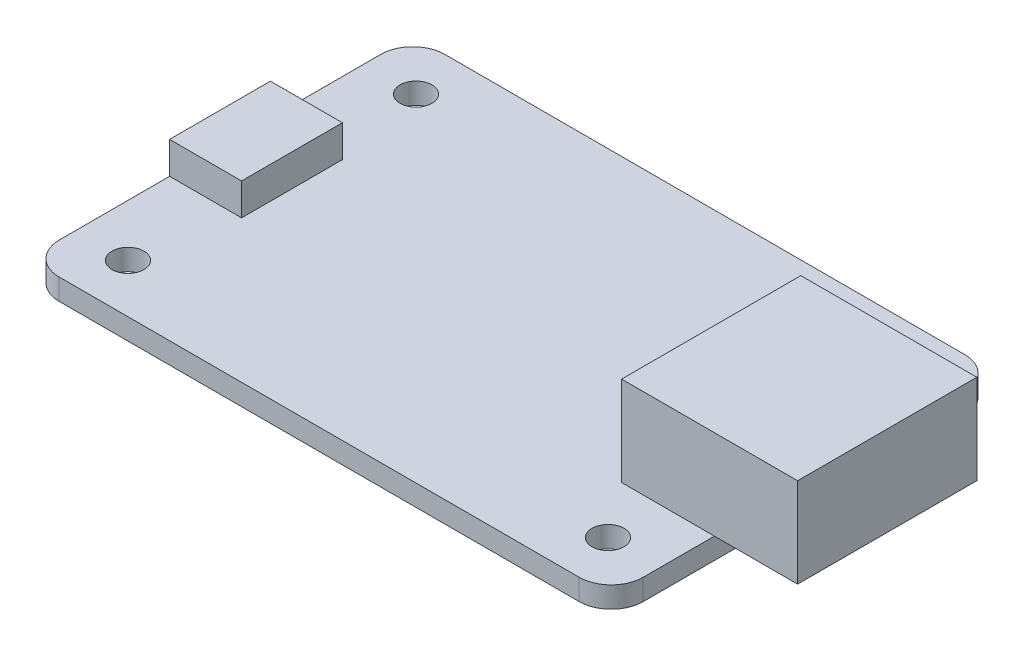
ISO-10303-21;
HEADER;
FILE_DESCRIPTION(('STEP AP214'),'2;1');
FILE_NAME('part.step','',(''),(''),'','','');
FILE_SCHEMA(('AUTOMOTIVE_DESIGN { 1 0 10303 214 1 1 1 1 }'));
ENDSEC;
DATA;
#1=APPLICATION_CONTEXT('core data for automotive mechanical design processes');
#2=APPLICATION_PROTOCOL_DEFINITION('international standard','automotive_design',2000,#1);
#3=PRODUCT_CONTEXT('',#1,'mechanical');
#4=PRODUCT('Part','Part','',(#3));
#5=PRODUCT_RELATED_PRODUCT_CATEGORY('part','',(#4));
#6=PRODUCT_DEFINITION_FORMATION('','',#4);
#7=PRODUCT_DEFINITION_CONTEXT('part definition',#1,'design');
#8=PRODUCT_DEFINITION('design','',#6,#7);
#9=PRODUCT_DEFINITION_SHAPE('','',#8);
#10=(LENGTH_UNIT() NAMED_UNIT(*) SI_UNIT(.MILLI.,.METRE.));
#11=(NAMED_UNIT(*) PLANE_ANGLE_UNIT() SI_UNIT($,.RADIAN.));
#12=(NAMED_UNIT(*) SI_UNIT($,.STERADIAN.) SOLID_ANGLE_UNIT());
#13=UNCERTAINTY_MEASURE_WITH_UNIT(LENGTH_MEASURE(1.E-05),#10,'distance_accuracy_value','');
#14=(GEOMETRIC_REPRESENTATION_CONTEXT(3) GLOBAL_UNCERTAINTY_ASSIGNED_CONTEXT((#13)) GLOBAL_UNIT_ASSIGNED_CONTEXT((#10,
#11,#12)) REPRESENTATION_CONTEXT('',''));
#15=CARTESIAN_POINT('',(0.,0.,0.));
#16=DIRECTION('',(0.,0.,1.));
#17=DIRECTION('',(1.,0.,0.));
#18=AXIS2_PLACEMENT_3D('',#15,#16,#17);
#19=CARTESIAN_POINT('',(0.,1.6764,0.));
#20=DIRECTION('',(0.,-1.,0.));
#21=DIRECTION('',(0.,0.,-1.));
#22=AXIS2_PLACEMENT_3D('',#19,#20,#21);
#23=PLANE('',#22);
#24=CARTESIAN_POINT('',(4.1275,1.6764,-26.7335));
#25=DIRECTION('',(0.,1.,0.));
#26=DIRECTION('',(0.,0.,1.));
#27=AXIS2_PLACEMENT_3D('',#24,#25,#26);
#28=CIRCLE('',#27,1.27);
#29=CARTESIAN_POINT('',(4.1275,1.6764,-25.4635));
#30=VERTEX_POINT('',#29);
#31=EDGE_CURVE('E266',#30,#30,#28,.T.);
#32=ORIENTED_EDGE('',*,*,#31,.F.);
#33=EDGE_LOOP('',(#32));
#34=FACE_BOUND('',#33,.T.);
#35=CARTESIAN_POINT('',(42.2275,1.6764,-26.7335));
#36=DIRECTION('',(0.,1.,0.));
#37=DIRECTION('',(0.,0.,1.));
#38=AXIS2_PLACEMENT_3D('',#35,#36,#37);
#39=CIRCLE('',#38,1.27);
#40=CARTESIAN_POINT('',(42.2275,1.6764,-25.4635));
#41=VERTEX_POINT('',#40);
#42=EDGE_CURVE('E258',#41,#41,#39,.T.);
#43=ORIENTED_EDGE('',*,*,#42,.F.);
#44=EDGE_LOOP('',(#43));
#45=FACE_BOUND('',#44,.T.);
#46=CARTESIAN_POINT('',(4.1275,1.6764,-3.8735));
#47=DIRECTION('',(0.,1.,0.));
#48=DIRECTION('',(0.,0.,1.));
#49=AXIS2_PLACEMENT_3D('',#46,#47,#48);
#50=CIRCLE('',#49,1.27);
#51=CARTESIAN_POINT('',(4.1275,1.6764,-2.6035));
#52=VERTEX_POINT('',#51);
#53=EDGE_CURVE('E250',#52,#52,#50,.T.);
#54=ORIENTED_EDGE('',*,*,#53,.F.);
#55=EDGE_LOOP('',(#54));
#56=FACE_BOUND('',#55,.T.);
#57=CARTESIAN_POINT('',(42.2275,1.6764,-3.8735));
#58=DIRECTION('',(0.,1.,0.));
#59=DIRECTION('',(0.,0.,1.));
#60=AXIS2_PLACEMENT_3D('',#57,#58,#59);
#61=CIRCLE('',#60,1.27);
#62=CARTESIAN_POINT('',(42.2275,1.6764,-2.60350000000001));
#63=VERTEX_POINT('',#62);
#64=EDGE_CURVE('E242',#63,#63,#61,.T.);
#65=ORIENTED_EDGE('',*,*,#64,.F.);
#66=EDGE_LOOP('',(#65));
#67=FACE_BOUND('',#66,.T.);
#68=DIRECTION('',(1.,0.,0.));
#69=VECTOR('',#68,1.);
#70=CARTESIAN_POINT('',(0.,1.6764,0.));
#71=LINE('',#70,#69);
#72=CARTESIAN_POINT('',(2.54,1.6764,0.));
#73=VERTEX_POINT('',#72);
#74=CARTESIAN_POINT('',(43.815,1.6764,0.));
#75=VERTEX_POINT('',#74);
#76=EDGE_CURVE('E277',#73,#75,#71,.T.);
#77=ORIENTED_EDGE('',*,*,#76,.T.);
#78=CARTESIAN_POINT('',(43.815,1.6764,-2.54));
#79=DIRECTION('',(0.,-1.,0.));
#80=DIRECTION('',(0.,0.,-1.));
#81=AXIS2_PLACEMENT_3D('',#78,#79,#80);
#82=CIRCLE('',#81,2.54);
#83=CARTESIAN_POINT('',(46.355,1.6764,-2.54));
#84=VERTEX_POINT('',#83);
#85=EDGE_CURVE('E336',#75,#84,#82,.F.);
#86=ORIENTED_EDGE('',*,*,#85,.T.);
#87=DIRECTION('',(0.,0.,-1.));
#88=VECTOR('',#87,1.);
#89=CARTESIAN_POINT('',(46.355,1.6764,0.));
#90=LINE('',#89,#88);
#91=CARTESIAN_POINT('',(46.355,1.6764,-8.1915));
#92=VERTEX_POINT('',#91);
#93=EDGE_CURVE('E282',#84,#92,#90,.T.);
#94=ORIENTED_EDGE('',*,*,#93,.T.);
#95=DIRECTION('',(1.,0.,0.));
#96=VECTOR('',#95,1.);
#97=CARTESIAN_POINT('',(38.989,1.6764,-8.1915));
#98=LINE('',#97,#96);
#99=CARTESIAN_POINT('',(38.989,1.6764,-8.1915));
#100=VERTEX_POINT('',#99);
#101=EDGE_CURVE('E204',#100,#92,#98,.T.);
#102=ORIENTED_EDGE('',*,*,#101,.F.);
#103=DIRECTION('',(0.,0.,1.));
#104=VECTOR('',#103,1.);
#105=CARTESIAN_POINT('',(38.989,1.6764,-8.1915));
#106=LINE('',#105,#104);
#107=CARTESIAN_POINT('',(38.989,1.6764,-22.4155));
#108=VERTEX_POINT('',#107);
#109=EDGE_CURVE('E217',#108,#100,#106,.T.);
#110=ORIENTED_EDGE('',*,*,#109,.F.);
#111=DIRECTION('',(-1.,0.,0.));
#112=VECTOR('',#111,1.);
#113=CARTESIAN_POINT('',(38.989,1.6764,-22.4155));
#114=LINE('',#113,#112);
#115=CARTESIAN_POINT('',(46.355,1.6764,-22.4155));
#116=VERTEX_POINT('',#115);
#117=EDGE_CURVE('E218',#116,#108,#114,.T.);
#118=ORIENTED_EDGE('',*,*,#117,.F.);
#119=CARTESIAN_POINT('',(46.355,1.6764,-28.067));
#120=VERTEX_POINT('',#119);
#121=EDGE_CURVE('E281',#116,#120,#90,.T.);
#122=ORIENTED_EDGE('',*,*,#121,.T.);
#123=CARTESIAN_POINT('',(43.815,1.6764,-28.067));
#124=DIRECTION('',(0.,-1.,0.));
#125=DIRECTION('',(0.,0.,-1.));
#126=AXIS2_PLACEMENT_3D('',#123,#124,#125);
#127=CIRCLE('',#126,2.54);
#128=CARTESIAN_POINT('',(43.815,1.6764,-30.607));
#129=VERTEX_POINT('',#128);
#130=EDGE_CURVE('E328',#120,#129,#127,.F.);
#131=ORIENTED_EDGE('',*,*,#130,.T.);
#132=DIRECTION('',(-1.,0.,0.));
#133=VECTOR('',#132,1.);
#134=CARTESIAN_POINT('',(0.,1.6764,-30.607));
#135=LINE('',#134,#133);
#136=CARTESIAN_POINT('',(2.54,1.6764,-30.607));
#137=VERTEX_POINT('',#136);
#138=EDGE_CURVE('E285',#129,#137,#135,.T.);
#139=ORIENTED_EDGE('',*,*,#138,.T.);
#140=CARTESIAN_POINT('',(2.54,1.6764,-28.067));
#141=DIRECTION('',(0.,-1.,0.));
#142=DIRECTION('',(0.,0.,-1.));
#143=AXIS2_PLACEMENT_3D('',#140,#141,#142);
#144=CIRCLE('',#143,2.54);
#145=CARTESIAN_POINT('',(0.,1.6764,-28.067));
#146=VERTEX_POINT('',#145);
#147=EDGE_CURVE('E54',#137,#146,#144,.F.);
#148=ORIENTED_EDGE('',*,*,#147,.T.);
#149=DIRECTION('',(0.,0.,1.));
#150=VECTOR('',#149,1.);
#151=CARTESIAN_POINT('',(0.,1.6764,0.));
#152=LINE('',#151,#150);
#153=CARTESIAN_POINT('',(0.,1.6764,-19.304));
#154=VERTEX_POINT('',#153);
#155=EDGE_CURVE('E274',#146,#154,#152,.T.);
#156=ORIENTED_EDGE('',*,*,#155,.T.);
#157=DIRECTION('',(-1.,0.,0.));
#158=VECTOR('',#157,1.);
#159=CARTESIAN_POINT('',(5.715,1.6764,-19.304));
#160=LINE('',#159,#158);
#161=CARTESIAN_POINT('',(5.715,1.6764,-19.304));
#162=VERTEX_POINT('',#161);
#163=EDGE_CURVE('E180',#162,#154,#160,.T.);
#164=ORIENTED_EDGE('',*,*,#163,.F.);
#165=DIRECTION('',(0.,0.,-1.));
#166=VECTOR('',#165,1.);
#167=CARTESIAN_POINT('',(5.715,1.6764,-19.304));
#168=LINE('',#167,#166);
#169=CARTESIAN_POINT('',(5.715,1.6764,-11.303));
#170=VERTEX_POINT('',#169);
#171=EDGE_CURVE('E369',#170,#162,#168,.T.);
#172=ORIENTED_EDGE('',*,*,#171,.F.);
#173=DIRECTION('',(1.,0.,0.));
#174=VECTOR('',#173,1.);
#175=CARTESIAN_POINT('',(5.715,1.6764,-11.303));
#176=LINE('',#175,#174);
#177=CARTESIAN_POINT('',(0.,1.6764,-11.303));
#178=VERTEX_POINT('',#177);
#179=EDGE_CURVE('E372',#178,#170,#176,.T.);
#180=ORIENTED_EDGE('',*,*,#179,.F.);
#181=CARTESIAN_POINT('',(0.,1.6764,-2.54));
#182=VERTEX_POINT('',#181);
#183=EDGE_CURVE('E185',#178,#182,#152,.T.);
#184=ORIENTED_EDGE('',*,*,#183,.T.);
#185=CARTESIAN_POINT('',(2.54,1.6764,-2.54));
#186=DIRECTION('',(0.,-1.,0.));
#187=DIRECTION('',(0.,0.,-1.));
#188=AXIS2_PLACEMENT_3D('',#185,#186,#187);
#189=CIRCLE('',#188,2.54);
#190=EDGE_CURVE('E333',#182,#73,#189,.F.);
#191=ORIENTED_EDGE('',*,*,#190,.T.);
#192=EDGE_LOOP('',(#77,#86,#94,#102,#110,#118,#122,#131,#139,#148,#156,#164,#172,#180,#184,#191));
#193=FACE_BOUND('',#192,.T.);
#194=ADVANCED_FACE('F38',(#34,#45,#56,#67,#193),#23,.F.);
#195=CARTESIAN_POINT('',(0.,0.,0.));
#196=DIRECTION('',(0.,-1.,0.));
#197=DIRECTION('',(0.,0.,-1.));
#198=AXIS2_PLACEMENT_3D('',#195,#196,#197);
#199=PLANE('',#198);
#200=CARTESIAN_POINT('',(4.1275,0.,-3.8735));
#201=DIRECTION('',(0.,1.,0.));
#202=DIRECTION('',(0.,0.,1.));
#203=AXIS2_PLACEMENT_3D('',#200,#201,#202);
#204=CIRCLE('',#203,1.27);
#205=CARTESIAN_POINT('',(4.1275,0.,-2.6035));
#206=VERTEX_POINT('',#205);
#207=EDGE_CURVE('E246',#206,#206,#204,.T.);
#208=ORIENTED_EDGE('',*,*,#207,.T.);
#209=EDGE_LOOP('',(#208));
#210=FACE_BOUND('',#209,.T.);
#211=CARTESIAN_POINT('',(4.1275,0.,-26.7335));
#212=DIRECTION('',(0.,1.,0.));
#213=DIRECTION('',(0.,0.,1.));
#214=AXIS2_PLACEMENT_3D('',#211,#212,#213);
#215=CIRCLE('',#214,1.27);
#216=CARTESIAN_POINT('',(4.1275,0.,-25.4635));
#217=VERTEX_POINT('',#216);
#218=EDGE_CURVE('E262',#217,#217,#215,.T.);
#219=ORIENTED_EDGE('',*,*,#218,.T.);
#220=EDGE_LOOP('',(#219));
#221=FACE_BOUND('',#220,.T.);
#222=DIRECTION('',(0.,0.,-1.));
#223=VECTOR('',#222,1.);
#224=CARTESIAN_POINT('',(46.355,0.,0.));
#225=LINE('',#224,#223);
#226=CARTESIAN_POINT('',(46.355,0.,-2.54));
#227=VERTEX_POINT('',#226);
#228=CARTESIAN_POINT('',(46.355,0.,-28.067));
#229=VERTEX_POINT('',#228);
#230=EDGE_CURVE('E295',#227,#229,#225,.T.);
#231=ORIENTED_EDGE('',*,*,#230,.F.);
#232=CARTESIAN_POINT('',(43.815,0.,-2.54));
#233=DIRECTION('',(0.,-1.,0.));
#234=DIRECTION('',(0.,0.,-1.));
#235=AXIS2_PLACEMENT_3D('',#232,#233,#234);
#236=CIRCLE('',#235,2.54);
#237=CARTESIAN_POINT('',(43.815,0.,0.));
#238=VERTEX_POINT('',#237);
#239=EDGE_CURVE('E318',#227,#238,#236,.T.);
#240=ORIENTED_EDGE('',*,*,#239,.T.);
#241=DIRECTION('',(1.,0.,0.));
#242=VECTOR('',#241,1.);
#243=CARTESIAN_POINT('',(0.,0.,0.));
#244=LINE('',#243,#242);
#245=CARTESIAN_POINT('',(2.54,0.,0.));
#246=VERTEX_POINT('',#245);
#247=EDGE_CURVE('E291',#246,#238,#244,.T.);
#248=ORIENTED_EDGE('',*,*,#247,.F.);
#249=CARTESIAN_POINT('',(2.54,0.,-2.54));
#250=DIRECTION('',(0.,-1.,0.));
#251=DIRECTION('',(0.,0.,-1.));
#252=AXIS2_PLACEMENT_3D('',#249,#250,#251);
#253=CIRCLE('',#252,2.54);
#254=CARTESIAN_POINT('',(0.,0.,-2.54));
#255=VERTEX_POINT('',#254);
#256=EDGE_CURVE('E315',#246,#255,#253,.T.);
#257=ORIENTED_EDGE('',*,*,#256,.T.);
#258=DIRECTION('',(0.,0.,1.));
#259=VECTOR('',#258,1.);
#260=CARTESIAN_POINT('',(0.,0.,0.));
#261=LINE('',#260,#259);
#262=CARTESIAN_POINT('',(0.,0.,-28.067));
#263=VERTEX_POINT('',#262);
#264=EDGE_CURVE('E270',#263,#255,#261,.T.);
#265=ORIENTED_EDGE('',*,*,#264,.F.);
#266=CARTESIAN_POINT('',(2.54,0.,-28.067));
#267=DIRECTION('',(0.,-1.,0.));
#268=DIRECTION('',(0.,0.,-1.));
#269=AXIS2_PLACEMENT_3D('',#266,#267,#268);
#270=CIRCLE('',#269,2.54);
#271=CARTESIAN_POINT('',(2.54,0.,-30.607));
#272=VERTEX_POINT('',#271);
#273=EDGE_CURVE('E312',#263,#272,#270,.T.);
#274=ORIENTED_EDGE('',*,*,#273,.T.);
#275=DIRECTION('',(-1.,0.,0.));
#276=VECTOR('',#275,1.);
#277=CARTESIAN_POINT('',(0.,0.,-30.607));
#278=LINE('',#277,#276);
#279=CARTESIAN_POINT('',(43.815,0.,-30.607));
#280=VERTEX_POINT('',#279);
#281=EDGE_CURVE('E299',#280,#272,#278,.T.);
#282=ORIENTED_EDGE('',*,*,#281,.F.);
#283=CARTESIAN_POINT('',(43.815,0.,-28.067));
#284=DIRECTION('',(0.,-1.,0.));
#285=DIRECTION('',(0.,0.,-1.));
#286=AXIS2_PLACEMENT_3D('',#283,#284,#285);
#287=CIRCLE('',#286,2.54);
#288=EDGE_CURVE('E309',#280,#229,#287,.T.);
#289=ORIENTED_EDGE('',*,*,#288,.T.);
#290=EDGE_LOOP('',(#231,#240,#248,#257,#265,#274,#282,#289));
#291=FACE_BOUND('',#290,.T.);
#292=CARTESIAN_POINT('',(42.2275,0.,-26.7335));
#293=DIRECTION('',(0.,1.,0.));
#294=DIRECTION('',(0.,0.,1.));
#295=AXIS2_PLACEMENT_3D('',#292,#293,#294);
#296=CIRCLE('',#295,1.27);
#297=CARTESIAN_POINT('',(42.2275,0.,-25.4635));
#298=VERTEX_POINT('',#297);
#299=EDGE_CURVE('E254',#298,#298,#296,.T.);
#300=ORIENTED_EDGE('',*,*,#299,.T.);
#301=EDGE_LOOP('',(#300));
#302=FACE_BOUND('',#301,.T.);
#303=CARTESIAN_POINT('',(42.2275,0.,-3.8735));
#304=DIRECTION('',(0.,1.,0.));
#305=DIRECTION('',(0.,0.,1.));
#306=AXIS2_PLACEMENT_3D('',#303,#304,#305);
#307=CIRCLE('',#306,1.27);
#308=CARTESIAN_POINT('',(42.2275,0.,-2.60350000000001));
#309=VERTEX_POINT('',#308);
#310=EDGE_CURVE('E241',#309,#309,#307,.T.);
#311=ORIENTED_EDGE('',*,*,#310,.T.);
#312=EDGE_LOOP('',(#311));
#313=FACE_BOUND('',#312,.T.);
#314=ADVANCED_FACE('F354',(#210,#221,#291,#302,#313),#199,.T.);
#315=CARTESIAN_POINT('',(0.,1.6764,0.));
#316=DIRECTION('',(1.,0.,0.));
#317=DIRECTION('',(0.,0.,-1.));
#318=AXIS2_PLACEMENT_3D('',#315,#316,#317);
#319=PLANE('',#318);
#320=ORIENTED_EDGE('',*,*,#264,.T.);
#321=DIRECTION('',(0.,-1.,0.));
#322=VECTOR('',#321,1.);
#323=CARTESIAN_POINT('',(0.,1.6764,-2.54));
#324=LINE('',#323,#322);
#325=EDGE_CURVE('E343',#255,#182,#324,.F.);
#326=ORIENTED_EDGE('',*,*,#325,.T.);
#327=ORIENTED_EDGE('',*,*,#183,.F.);
#328=DIRECTION('',(0.,-1.,0.));
#329=VECTOR('',#328,1.);
#330=CARTESIAN_POINT('',(0.,4.2164,-11.303));
#331=LINE('',#330,#329);
#332=CARTESIAN_POINT('',(0.,4.2164,-11.303));
#333=VERTEX_POINT('',#332);
#334=EDGE_CURVE('E163',#333,#178,#331,.T.);
#335=ORIENTED_EDGE('',*,*,#334,.F.);
#336=DIRECTION('',(0.,0.,1.));
#337=VECTOR('',#336,1.);
#338=CARTESIAN_POINT('',(0.,4.2164,-19.304));
#339=LINE('',#338,#337);
#340=CARTESIAN_POINT('',(0.,4.2164,-19.304));
#341=VERTEX_POINT('',#340);
#342=EDGE_CURVE('E170',#341,#333,#339,.T.);
#343=ORIENTED_EDGE('',*,*,#342,.F.);
#344=DIRECTION('',(0.,-1.,0.));
#345=VECTOR('',#344,1.);
#346=CARTESIAN_POINT('',(0.,4.2164,-19.304));
#347=LINE('',#346,#345);
#348=EDGE_CURVE('E361',#341,#154,#347,.T.);
#349=ORIENTED_EDGE('',*,*,#348,.T.);
#350=ORIENTED_EDGE('',*,*,#155,.F.);
#351=DIRECTION('',(0.,-1.,0.));
#352=VECTOR('',#351,1.);
#353=CARTESIAN_POINT('',(0.,1.6764,-28.067));
#354=LINE('',#353,#352);
#355=EDGE_CURVE('E339',#146,#263,#354,.T.);
#356=ORIENTED_EDGE('',*,*,#355,.T.);
#357=EDGE_LOOP('',(#320,#326,#327,#335,#343,#349,#350,#356));
#358=FACE_BOUND('',#357,.T.);
#359=ADVANCED_FACE('F183',(#358),#319,.F.);
#360=CARTESIAN_POINT('',(0.,1.6764,0.));
#361=DIRECTION('',(0.,0.,-1.));
#362=DIRECTION('',(-1.,0.,0.));
#363=AXIS2_PLACEMENT_3D('',#360,#361,#362);
#364=PLANE('',#363);
#365=ORIENTED_EDGE('',*,*,#247,.T.);
#366=DIRECTION('',(0.,-1.,0.));
#367=VECTOR('',#366,1.);
#368=CARTESIAN_POINT('',(43.815,1.6764,0.));
#369=LINE('',#368,#367);
#370=EDGE_CURVE('E325',#238,#75,#369,.F.);
#371=ORIENTED_EDGE('',*,*,#370,.T.);
#372=ORIENTED_EDGE('',*,*,#76,.F.);
#373=DIRECTION('',(0.,-1.,0.));
#374=VECTOR('',#373,1.);
#375=CARTESIAN_POINT('',(2.54,1.6764,0.));
#376=LINE('',#375,#374);
#377=EDGE_CURVE('E321',#73,#246,#376,.T.);
#378=ORIENTED_EDGE('',*,*,#377,.T.);
#379=EDGE_LOOP('',(#365,#371,#372,#378));
#380=FACE_BOUND('',#379,.T.);
#381=ADVANCED_FACE('F414',(#380),#364,.F.);
#382=CARTESIAN_POINT('',(46.355,1.6764,0.));
#383=DIRECTION('',(-1.,0.,0.));
#384=DIRECTION('',(0.,0.,1.));
#385=AXIS2_PLACEMENT_3D('',#382,#383,#384);
#386=PLANE('',#385);
#387=ORIENTED_EDGE('',*,*,#93,.F.);
#388=DIRECTION('',(0.,-1.,0.));
#389=VECTOR('',#388,1.);
#390=CARTESIAN_POINT('',(46.355,1.6764,-2.54));
#391=LINE('',#390,#389);
#392=EDGE_CURVE('E305',#84,#227,#391,.T.);
#393=ORIENTED_EDGE('',*,*,#392,.T.);
#394=ORIENTED_EDGE('',*,*,#230,.T.);
#395=DIRECTION('',(0.,-1.,0.));
#396=VECTOR('',#395,1.);
#397=CARTESIAN_POINT('',(46.355,1.6764,-28.067));
#398=LINE('',#397,#396);
#399=EDGE_CURVE('E302',#229,#120,#398,.F.);
#400=ORIENTED_EDGE('',*,*,#399,.T.);
#401=ORIENTED_EDGE('',*,*,#121,.F.);
#402=EDGE_CURVE('E286',#92,#116,#90,.T.);
#403=ORIENTED_EDGE('',*,*,#402,.F.);
#404=EDGE_LOOP('',(#387,#393,#394,#400,#401,#403));
#405=FACE_BOUND('',#404,.T.);
#406=ADVANCED_FACE('F411',(#405),#386,.F.);
#407=CARTESIAN_POINT('',(0.,1.6764,-30.607));
#408=DIRECTION('',(0.,0.,1.));
#409=DIRECTION('',(1.,0.,0.));
#410=AXIS2_PLACEMENT_3D('',#407,#408,#409);
#411=PLANE('',#410);
#412=ORIENTED_EDGE('',*,*,#281,.T.);
#413=DIRECTION('',(0.,-1.,0.));
#414=VECTOR('',#413,1.);
#415=CARTESIAN_POINT('',(2.54,1.6764,-30.607));
#416=LINE('',#415,#414);
#417=EDGE_CURVE('E11',#272,#137,#416,.F.);
#418=ORIENTED_EDGE('',*,*,#417,.T.);
#419=ORIENTED_EDGE('',*,*,#138,.F.);
#420=DIRECTION('',(0.,-1.,0.));
#421=VECTOR('',#420,1.);
#422=CARTESIAN_POINT('',(43.815,1.6764,-30.607));
#423=LINE('',#422,#421);
#424=EDGE_CURVE('E47',#129,#280,#423,.T.);
#425=ORIENTED_EDGE('',*,*,#424,.T.);
#426=EDGE_LOOP('',(#412,#418,#419,#425));
#427=FACE_BOUND('',#426,.T.);
#428=ADVANCED_FACE('F349',(#427),#411,.F.);
#429=CARTESIAN_POINT('',(4.1275,1.6764,-26.7335));
#430=DIRECTION('',(0.,-1.,0.));
#431=DIRECTION('',(0.,0.,-1.));
#432=AXIS2_PLACEMENT_3D('',#429,#430,#431);
#433=CYLINDRICAL_SURFACE('',#432,1.27);
#434=ORIENTED_EDGE('',*,*,#31,.T.);
#435=EDGE_LOOP('',(#434));
#436=FACE_BOUND('',#435,.T.);
#437=ORIENTED_EDGE('',*,*,#218,.F.);
#438=EDGE_LOOP('',(#437));
#439=FACE_BOUND('',#438,.T.);
#440=ADVANCED_FACE('F406',(#436,#439),#433,.F.);
#441=CARTESIAN_POINT('',(42.2275,1.6764,-26.7335));
#442=DIRECTION('',(0.,-1.,0.));
#443=DIRECTION('',(0.,0.,-1.));
#444=AXIS2_PLACEMENT_3D('',#441,#442,#443);
#445=CYLINDRICAL_SURFACE('',#444,1.27);
#446=ORIENTED_EDGE('',*,*,#42,.T.);
#447=EDGE_LOOP('',(#446));
#448=FACE_BOUND('',#447,.T.);
#449=ORIENTED_EDGE('',*,*,#299,.F.);
#450=EDGE_LOOP('',(#449));
#451=FACE_BOUND('',#450,.T.);
#452=ADVANCED_FACE('F493',(#448,#451),#445,.F.);
#453=CARTESIAN_POINT('',(4.1275,1.6764,-3.8735));
#454=DIRECTION('',(0.,-1.,0.));
#455=DIRECTION('',(0.,0.,-1.));
#456=AXIS2_PLACEMENT_3D('',#453,#454,#455);
#457=CYLINDRICAL_SURFACE('',#456,1.27);
#458=ORIENTED_EDGE('',*,*,#53,.T.);
#459=EDGE_LOOP('',(#458));
#460=FACE_BOUND('',#459,.T.);
#461=ORIENTED_EDGE('',*,*,#207,.F.);
#462=EDGE_LOOP('',(#461));
#463=FACE_BOUND('',#462,.T.);
#464=ADVANCED_FACE('F490',(#460,#463),#457,.F.);
#465=CARTESIAN_POINT('',(42.2275,1.6764,-3.8735));
#466=DIRECTION('',(0.,-1.,0.));
#467=DIRECTION('',(0.,0.,-1.));
#468=AXIS2_PLACEMENT_3D('',#465,#466,#467);
#469=CYLINDRICAL_SURFACE('',#468,1.27);
#470=ORIENTED_EDGE('',*,*,#64,.T.);
#471=EDGE_LOOP('',(#470));
#472=FACE_BOUND('',#471,.T.);
#473=ORIENTED_EDGE('',*,*,#310,.F.);
#474=EDGE_LOOP('',(#473));
#475=FACE_BOUND('',#474,.T.);
#476=ADVANCED_FACE('F487',(#472,#475),#469,.F.);
#477=CARTESIAN_POINT('',(52.959,8.7884,-8.1915));
#478=DIRECTION('',(-1.,0.,0.));
#479=DIRECTION('',(0.,0.,1.));
#480=AXIS2_PLACEMENT_3D('',#477,#478,#479);
#481=PLANE('',#480);
#482=DIRECTION('',(0.,0.,-1.));
#483=VECTOR('',#482,1.);
#484=CARTESIAN_POINT('',(52.959,1.6764,-8.1915));
#485=LINE('',#484,#483);
#486=CARTESIAN_POINT('',(52.959,1.6764,-8.1915));
#487=VERTEX_POINT('',#486);
#488=CARTESIAN_POINT('',(52.959,1.6764,-22.4155));
#489=VERTEX_POINT('',#488);
#490=EDGE_CURVE('E188',#487,#489,#485,.T.);
#491=ORIENTED_EDGE('',*,*,#490,.T.);
#492=DIRECTION('',(0.,-1.,0.));
#493=VECTOR('',#492,1.);
#494=CARTESIAN_POINT('',(52.959,8.7884,-22.4155));
#495=LINE('',#494,#493);
#496=CARTESIAN_POINT('',(52.959,8.7884,-22.4155));
#497=VERTEX_POINT('',#496);
#498=EDGE_CURVE('E237',#497,#489,#495,.T.);
#499=ORIENTED_EDGE('',*,*,#498,.F.);
#500=DIRECTION('',(0.,0.,-1.));
#501=VECTOR('',#500,1.);
#502=CARTESIAN_POINT('',(52.959,8.7884,-8.1915));
#503=LINE('',#502,#501);
#504=CARTESIAN_POINT('',(52.959,8.7884,-8.1915));
#505=VERTEX_POINT('',#504);
#506=EDGE_CURVE('E199',#505,#497,#503,.T.);
#507=ORIENTED_EDGE('',*,*,#506,.F.);
#508=DIRECTION('',(0.,-1.,0.));
#509=VECTOR('',#508,1.);
#510=CARTESIAN_POINT('',(52.959,8.7884,-8.1915));
#511=LINE('',#510,#509);
#512=EDGE_CURVE('E212',#505,#487,#511,.T.);
#513=ORIENTED_EDGE('',*,*,#512,.T.);
#514=EDGE_LOOP('',(#491,#499,#507,#513));
#515=FACE_BOUND('',#514,.T.);
#516=ADVANCED_FACE('F452',(#515),#481,.F.);
#517=CARTESIAN_POINT('',(38.989,8.7884,-22.4155));
#518=DIRECTION('',(0.,0.,1.));
#519=DIRECTION('',(1.,0.,0.));
#520=AXIS2_PLACEMENT_3D('',#517,#518,#519);
#521=PLANE('',#520);
#522=EDGE_CURVE('E193',#489,#116,#114,.T.);
#523=ORIENTED_EDGE('',*,*,#522,.T.);
#524=ORIENTED_EDGE('',*,*,#117,.T.);
#525=DIRECTION('',(0.,-1.,0.));
#526=VECTOR('',#525,1.);
#527=CARTESIAN_POINT('',(38.989,8.7884,-22.4155));
#528=LINE('',#527,#526);
#529=CARTESIAN_POINT('',(38.989,8.7884,-22.4155));
#530=VERTEX_POINT('',#529);
#531=EDGE_CURVE('E233',#530,#108,#528,.T.);
#532=ORIENTED_EDGE('',*,*,#531,.F.);
#533=DIRECTION('',(-1.,0.,0.));
#534=VECTOR('',#533,1.);
#535=CARTESIAN_POINT('',(38.989,8.7884,-22.4155));
#536=LINE('',#535,#534);
#537=EDGE_CURVE('E203',#497,#530,#536,.T.);
#538=ORIENTED_EDGE('',*,*,#537,.F.);
#539=ORIENTED_EDGE('',*,*,#498,.T.);
#540=EDGE_LOOP('',(#523,#524,#532,#538,#539));
#541=FACE_BOUND('',#540,.T.);
#542=ADVANCED_FACE('F447',(#541),#521,.F.);
#543=CARTESIAN_POINT('',(38.989,8.7884,-8.1915));
#544=DIRECTION('',(1.,0.,0.));
#545=DIRECTION('',(0.,0.,-1.));
#546=AXIS2_PLACEMENT_3D('',#543,#544,#545);
#547=PLANE('',#546);
#548=ORIENTED_EDGE('',*,*,#109,.T.);
#549=DIRECTION('',(0.,-1.,0.));
#550=VECTOR('',#549,1.);
#551=CARTESIAN_POINT('',(38.989,8.7884,-8.1915));
#552=LINE('',#551,#550);
#553=CARTESIAN_POINT('',(38.989,8.7884,-8.1915));
#554=VERTEX_POINT('',#553);
#555=EDGE_CURVE('E229',#554,#100,#552,.T.);
#556=ORIENTED_EDGE('',*,*,#555,.F.);
#557=DIRECTION('',(0.,0.,1.));
#558=VECTOR('',#557,1.);
#559=CARTESIAN_POINT('',(38.989,8.7884,-8.1915));
#560=LINE('',#559,#558);
#561=EDGE_CURVE('E207',#530,#554,#560,.T.);
#562=ORIENTED_EDGE('',*,*,#561,.F.);
#563=ORIENTED_EDGE('',*,*,#531,.T.);
#564=EDGE_LOOP('',(#548,#556,#562,#563));
#565=FACE_BOUND('',#564,.T.);
#566=ADVANCED_FACE('F468',(#565),#547,.F.);
#567=CARTESIAN_POINT('',(38.989,8.7884,-8.1915));
#568=DIRECTION('',(0.,0.,-1.));
#569=DIRECTION('',(-1.,0.,0.));
#570=AXIS2_PLACEMENT_3D('',#567,#568,#569);
#571=PLANE('',#570);
#572=ORIENTED_EDGE('',*,*,#101,.T.);
#573=EDGE_CURVE('E222',#92,#487,#98,.T.);
#574=ORIENTED_EDGE('',*,*,#573,.T.);
#575=ORIENTED_EDGE('',*,*,#512,.F.);
#576=DIRECTION('',(1.,0.,0.));
#577=VECTOR('',#576,1.);
#578=CARTESIAN_POINT('',(38.989,8.7884,-8.1915));
#579=LINE('',#578,#577);
#580=EDGE_CURVE('E210',#554,#505,#579,.T.);
#581=ORIENTED_EDGE('',*,*,#580,.F.);
#582=ORIENTED_EDGE('',*,*,#555,.T.);
#583=EDGE_LOOP('',(#572,#574,#575,#581,#582));
#584=FACE_BOUND('',#583,.T.);
#585=ADVANCED_FACE('F456',(#584),#571,.F.);
#586=CARTESIAN_POINT('',(0.,8.7884,0.));
#587=DIRECTION('',(0.,-1.,0.));
#588=DIRECTION('',(0.,0.,-1.));
#589=AXIS2_PLACEMENT_3D('',#586,#587,#588);
#590=PLANE('',#589);
#591=ORIENTED_EDGE('',*,*,#506,.T.);
#592=ORIENTED_EDGE('',*,*,#537,.T.);
#593=ORIENTED_EDGE('',*,*,#561,.T.);
#594=ORIENTED_EDGE('',*,*,#580,.T.);
#595=EDGE_LOOP('',(#591,#592,#593,#594));
#596=FACE_BOUND('',#595,.T.);
#597=ADVANCED_FACE('F471',(#596),#590,.F.);
#598=CARTESIAN_POINT('',(0.,1.6764,0.));
#599=DIRECTION('',(0.,-1.,0.));
#600=DIRECTION('',(0.,0.,-1.));
#601=AXIS2_PLACEMENT_3D('',#598,#599,#600);
#602=PLANE('',#601);
#603=ORIENTED_EDGE('',*,*,#573,.F.);
#604=ORIENTED_EDGE('',*,*,#402,.T.);
#605=ORIENTED_EDGE('',*,*,#522,.F.);
#606=ORIENTED_EDGE('',*,*,#490,.F.);
#607=EDGE_LOOP('',(#603,#604,#605,#606));
#608=FACE_BOUND('',#607,.T.);
#609=ADVANCED_FACE('F392',(#608),#602,.T.);
#610=CARTESIAN_POINT('',(5.715,4.2164,-11.303));
#611=DIRECTION('',(0.,0.,-1.));
#612=DIRECTION('',(-1.,0.,0.));
#613=AXIS2_PLACEMENT_3D('',#610,#611,#612);
#614=PLANE('',#613);
#615=ORIENTED_EDGE('',*,*,#179,.T.);
#616=DIRECTION('',(0.,-1.,0.));
#617=VECTOR('',#616,1.);
#618=CARTESIAN_POINT('',(5.715,4.2164,-11.303));
#619=LINE('',#618,#617);
#620=CARTESIAN_POINT('',(5.715,4.2164,-11.303));
#621=VERTEX_POINT('',#620);
#622=EDGE_CURVE('E165',#621,#170,#619,.T.);
#623=ORIENTED_EDGE('',*,*,#622,.F.);
#624=DIRECTION('',(1.,0.,0.));
#625=VECTOR('',#624,1.);
#626=CARTESIAN_POINT('',(5.715,4.2164,-11.303));
#627=LINE('',#626,#625);
#628=EDGE_CURVE('E158',#333,#621,#627,.T.);
#629=ORIENTED_EDGE('',*,*,#628,.F.);
#630=ORIENTED_EDGE('',*,*,#334,.T.);
#631=EDGE_LOOP('',(#615,#623,#629,#630));
#632=FACE_BOUND('',#631,.T.);
#633=ADVANCED_FACE('F161',(#632),#614,.F.);
#634=CARTESIAN_POINT('',(5.715,4.2164,-19.304));
#635=DIRECTION('',(-1.,0.,0.));
#636=DIRECTION('',(0.,0.,1.));
#637=AXIS2_PLACEMENT_3D('',#634,#635,#636);
#638=PLANE('',#637);
#639=ORIENTED_EDGE('',*,*,#171,.T.);
#640=DIRECTION('',(0.,-1.,0.));
#641=VECTOR('',#640,1.);
#642=CARTESIAN_POINT('',(5.715,4.2164,-19.304));
#643=LINE('',#642,#641);
#644=CARTESIAN_POINT('',(5.715,4.2164,-19.304));
#645=VERTEX_POINT('',#644);
#646=EDGE_CURVE('E195',#645,#162,#643,.T.);
#647=ORIENTED_EDGE('',*,*,#646,.F.);
#648=DIRECTION('',(0.,0.,-1.));
#649=VECTOR('',#648,1.);
#650=CARTESIAN_POINT('',(5.715,4.2164,-19.304));
#651=LINE('',#650,#649);
#652=EDGE_CURVE('E169',#621,#645,#651,.T.);
#653=ORIENTED_EDGE('',*,*,#652,.F.);
#654=ORIENTED_EDGE('',*,*,#622,.T.);
#655=EDGE_LOOP('',(#639,#647,#653,#654));
#656=FACE_BOUND('',#655,.T.);
#657=ADVANCED_FACE('F384',(#656),#638,.F.);
#658=CARTESIAN_POINT('',(5.715,4.2164,-19.304));
#659=DIRECTION('',(0.,0.,1.));
#660=DIRECTION('',(1.,0.,0.));
#661=AXIS2_PLACEMENT_3D('',#658,#659,#660);
#662=PLANE('',#661);
#663=ORIENTED_EDGE('',*,*,#163,.T.);
#664=ORIENTED_EDGE('',*,*,#348,.F.);
#665=DIRECTION('',(-1.,0.,0.));
#666=VECTOR('',#665,1.);
#667=CARTESIAN_POINT('',(5.715,4.2164,-19.304));
#668=LINE('',#667,#666);
#669=EDGE_CURVE('E175',#645,#341,#668,.T.);
#670=ORIENTED_EDGE('',*,*,#669,.F.);
#671=ORIENTED_EDGE('',*,*,#646,.T.);
#672=EDGE_LOOP('',(#663,#664,#670,#671));
#673=FACE_BOUND('',#672,.T.);
#674=ADVANCED_FACE('F366',(#673),#662,.F.);
#675=CARTESIAN_POINT('',(0.,4.2164,0.));
#676=DIRECTION('',(0.,-1.,0.));
#677=DIRECTION('',(0.,0.,-1.));
#678=AXIS2_PLACEMENT_3D('',#675,#676,#677);
#679=PLANE('',#678);
#680=ORIENTED_EDGE('',*,*,#342,.T.);
#681=ORIENTED_EDGE('',*,*,#628,.T.);
#682=ORIENTED_EDGE('',*,*,#652,.T.);
#683=ORIENTED_EDGE('',*,*,#669,.T.);
#684=EDGE_LOOP('',(#680,#681,#682,#683));
#685=FACE_BOUND('',#684,.T.);
#686=ADVANCED_FACE('F173',(#685),#679,.F.);
#687=CARTESIAN_POINT('',(43.815,1.6764,-2.54));
#688=DIRECTION('',(0.,-1.,0.));
#689=DIRECTION('',(0.,0.,-1.));
#690=AXIS2_PLACEMENT_3D('',#687,#688,#689);
#691=CYLINDRICAL_SURFACE('',#690,2.54);
#692=ORIENTED_EDGE('',*,*,#85,.F.);
#693=ORIENTED_EDGE('',*,*,#370,.F.);
#694=ORIENTED_EDGE('',*,*,#239,.F.);
#695=ORIENTED_EDGE('',*,*,#392,.F.);
#696=EDGE_LOOP('',(#692,#693,#694,#695));
#697=FACE_BOUND('',#696,.T.);
#698=ADVANCED_FACE('F421',(#697),#691,.T.);
#699=CARTESIAN_POINT('',(2.54,1.6764,-2.54));
#700=DIRECTION('',(0.,-1.,0.));
#701=DIRECTION('',(0.,0.,-1.));
#702=AXIS2_PLACEMENT_3D('',#699,#700,#701);
#703=CYLINDRICAL_SURFACE('',#702,2.54);
#704=ORIENTED_EDGE('',*,*,#190,.F.);
#705=ORIENTED_EDGE('',*,*,#325,.F.);
#706=ORIENTED_EDGE('',*,*,#256,.F.);
#707=ORIENTED_EDGE('',*,*,#377,.F.);
#708=EDGE_LOOP('',(#704,#705,#706,#707));
#709=FACE_BOUND('',#708,.T.);
#710=ADVANCED_FACE('F424',(#709),#703,.T.);
#711=CARTESIAN_POINT('',(2.54,1.6764,-28.067));
#712=DIRECTION('',(0.,-1.,0.));
#713=DIRECTION('',(0.,0.,-1.));
#714=AXIS2_PLACEMENT_3D('',#711,#712,#713);
#715=CYLINDRICAL_SURFACE('',#714,2.54);
#716=ORIENTED_EDGE('',*,*,#147,.F.);
#717=ORIENTED_EDGE('',*,*,#417,.F.);
#718=ORIENTED_EDGE('',*,*,#273,.F.);
#719=ORIENTED_EDGE('',*,*,#355,.F.);
#720=EDGE_LOOP('',(#716,#717,#718,#719));
#721=FACE_BOUND('',#720,.T.);
#722=ADVANCED_FACE('F359',(#721),#715,.T.);
#723=CARTESIAN_POINT('',(43.815,1.6764,-28.067));
#724=DIRECTION('',(0.,-1.,0.));
#725=DIRECTION('',(0.,0.,-1.));
#726=AXIS2_PLACEMENT_3D('',#723,#724,#725);
#727=CYLINDRICAL_SURFACE('',#726,2.54);
#728=ORIENTED_EDGE('',*,*,#130,.F.);
#729=ORIENTED_EDGE('',*,*,#399,.F.);
#730=ORIENTED_EDGE('',*,*,#288,.F.);
#731=ORIENTED_EDGE('',*,*,#424,.F.);
#732=EDGE_LOOP('',(#728,#729,#730,#731));
#733=FACE_BOUND('',#732,.T.);
#734=ADVANCED_FACE('F40',(#733),#727,.T.);
#735=CLOSED_SHELL('',(#194,#314,#359,#381,#406,#428,#440,#452,#464,#476,#516,#542,#566,#585,
#597,#609,#633,#657,#674,#686,#698,#710,#722,#734));
#736=MANIFOLD_SOLID_BREP('B2',#735);
#737=ADVANCED_BREP_SHAPE_REPRESENTATION('',(#18,#736),#14);
#738=SHAPE_DEFINITION_REPRESENTATION(#9,#737);
ENDSEC;
END-ISO-10303-21;
